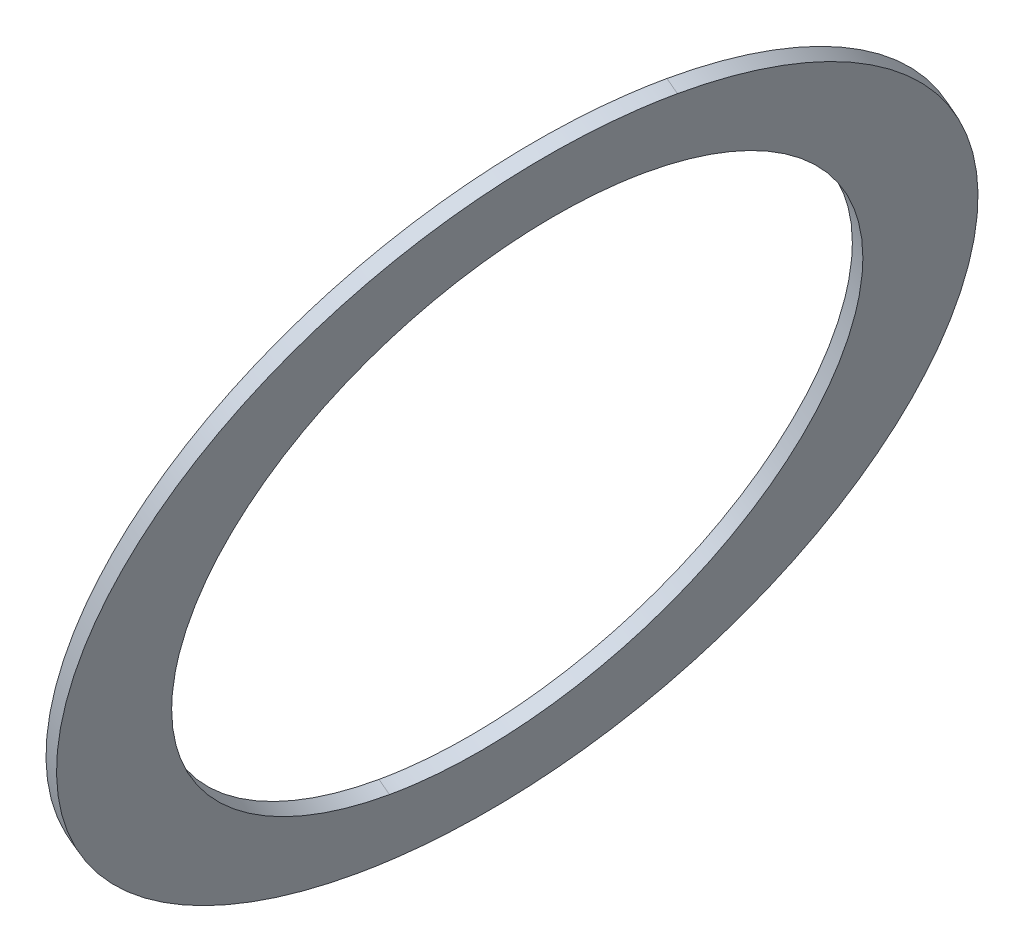
ISO-10303-21;
HEADER;
FILE_DESCRIPTION(('STEP AP214'),'2;1');
FILE_NAME('part.step','',(''),(''),'','','');
FILE_SCHEMA(('AUTOMOTIVE_DESIGN { 1 0 10303 214 1 1 1 1 }'));
ENDSEC;
DATA;
#1=APPLICATION_CONTEXT('core data for automotive mechanical design processes');
#2=APPLICATION_PROTOCOL_DEFINITION('international standard','automotive_design',2000,#1);
#3=PRODUCT_CONTEXT('',#1,'mechanical');
#4=PRODUCT('Part','Part','',(#3));
#5=PRODUCT_RELATED_PRODUCT_CATEGORY('part','',(#4));
#6=PRODUCT_DEFINITION_FORMATION('','',#4);
#7=PRODUCT_DEFINITION_CONTEXT('part definition',#1,'design');
#8=PRODUCT_DEFINITION('design','',#6,#7);
#9=PRODUCT_DEFINITION_SHAPE('','',#8);
#10=(LENGTH_UNIT() NAMED_UNIT(*) SI_UNIT(.MILLI.,.METRE.));
#11=(NAMED_UNIT(*) PLANE_ANGLE_UNIT() SI_UNIT($,.RADIAN.));
#12=(NAMED_UNIT(*) SI_UNIT($,.STERADIAN.) SOLID_ANGLE_UNIT());
#13=UNCERTAINTY_MEASURE_WITH_UNIT(LENGTH_MEASURE(1.E-05),#10,'distance_accuracy_value','');
#14=(GEOMETRIC_REPRESENTATION_CONTEXT(3) GLOBAL_UNCERTAINTY_ASSIGNED_CONTEXT((#13)) GLOBAL_UNIT_ASSIGNED_CONTEXT((#10,
#11,#12)) REPRESENTATION_CONTEXT('',''));
#15=CARTESIAN_POINT('',(0.,0.,0.));
#16=DIRECTION('',(0.,0.,1.));
#17=DIRECTION('',(1.,0.,0.));
#18=AXIS2_PLACEMENT_3D('',#15,#16,#17);
#19=CARTESIAN_POINT('',(-144.227128583511,60.3736028825918,-140.76318788377));
#20=CARTESIAN_POINT('',(-144.250846109872,60.3778785643696,-140.629687018861));
#21=CARTESIAN_POINT('',(-144.26073472639,60.4159766948373,-140.494893857274));
#22=CARTESIAN_POINT('',(-144.254387010655,60.4877548396206,-140.371723937592));
#23=CARTESIAN_POINT('',(-144.209627708789,60.7102810297389,-140.121191960141));
#24=CARTESIAN_POINT('',(-144.108019334336,61.0180985513555,-139.982467653901));
#25=CARTESIAN_POINT('',(-144.035286032677,61.2115475418357,-139.941766379022));
#26=CARTESIAN_POINT('',(-143.897642443855,61.5429373472106,-139.94035648523));
#27=CARTESIAN_POINT('',(-143.752515715508,61.8369160140306,-140.059647796519));
#28=CARTESIAN_POINT('',(-143.69213029429,61.9492143052552,-140.131122833859));
#29=CARTESIAN_POINT('',(-143.603782133636,62.0945954927457,-140.276921262348));
#30=CARTESIAN_POINT('',(-143.53385879928,62.1755594337511,-140.466614751167));
#31=CARTESIAN_POINT('',(-143.512078593367,62.1948247504121,-140.538675476068));
#32=CARTESIAN_POINT('',(-143.494263927853,62.2032150484233,-140.613669713486));
#33=CARTESIAN_POINT('',(-143.480858302723,62.2007983466927,-140.689127099815));
#34=B_SPLINE_CURVE_WITH_KNOTS('',5,(#19,#20,#21,#22,#23,#24,#25,#26,#27,#28,#29,#30,#31,#32,
#33),.UNSPECIFIED.,.F.,.F.,(6,3,3,3,6),(0.,0.249030806576429,0.604169804532782,
0.859242756203596,1.),.UNSPECIFIED.);
#35=DIRECTION('',(-0.909215143405846,0.378383579710355,-0.173648177666983));
#36=VECTOR('',#35,1.);
#37=SURFACE_OF_LINEAR_EXTRUSION('',#34,#36);
#38=DIRECTION('',(0.909215143405846,-0.378383579710355,0.173648177666983));
#39=VECTOR('',#38,1.);
#40=CARTESIAN_POINT('',(-144.240766810662,60.3792786362875,-140.765792606435));
#41=LINE('',#40,#39);
#42=CARTESIAN_POINT('',(-144.254405037813,60.3849543899831,-140.7683973291));
#43=VERTEX_POINT('',#42);
#44=CARTESIAN_POINT('',(-144.227128583511,60.3736028825918,-140.76318788377));
#45=VERTEX_POINT('',#44);
#46=EDGE_CURVE('E11',#43,#45,#41,.T.);
#47=ORIENTED_EDGE('',*,*,#46,.T.);
#48=CARTESIAN_POINT('',(-144.227128583511,60.3736028825918,-140.76318788377));
#49=CARTESIAN_POINT('',(-144.250846109872,60.3778785643696,-140.629687018861));
#50=CARTESIAN_POINT('',(-144.26073472639,60.4159766948373,-140.494893857274));
#51=CARTESIAN_POINT('',(-144.254387010655,60.4877548396206,-140.371723937592));
#52=CARTESIAN_POINT('',(-144.209627708789,60.7102810297389,-140.121191960141));
#53=CARTESIAN_POINT('',(-144.108019334336,61.0180985513555,-139.982467653901));
#54=CARTESIAN_POINT('',(-144.035286032677,61.2115475418357,-139.941766379022));
#55=CARTESIAN_POINT('',(-143.897642443855,61.5429373472106,-139.94035648523));
#56=CARTESIAN_POINT('',(-143.752515715508,61.8369160140306,-140.059647796519));
#57=CARTESIAN_POINT('',(-143.69213029429,61.9492143052552,-140.131122833859));
#58=CARTESIAN_POINT('',(-143.603782133636,62.0945954927457,-140.276921262348));
#59=CARTESIAN_POINT('',(-143.53385879928,62.1755594337511,-140.466614751167));
#60=CARTESIAN_POINT('',(-143.512078593367,62.1948247504121,-140.538675476068));
#61=CARTESIAN_POINT('',(-143.494263927853,62.2032150484233,-140.613669713486));
#62=CARTESIAN_POINT('',(-143.480858302723,62.2007983466927,-140.689127099815));
#63=B_SPLINE_CURVE_WITH_KNOTS('',5,(#48,#49,#50,#51,#52,#53,#54,#55,#56,#57,#58,#59,#60,#61,
#62),.UNSPECIFIED.,.F.,.F.,(6,3,3,3,6),(0.,0.249030806576429,0.604169804532782,
0.859242756203596,1.),.UNSPECIFIED.);
#64=CARTESIAN_POINT('',(-143.480858302723,62.2007983466927,-140.689127099815));
#65=VERTEX_POINT('',#64);
#66=EDGE_CURVE('E33',#45,#65,#63,.T.);
#67=ORIENTED_EDGE('',*,*,#66,.T.);
#68=DIRECTION('',(0.909215143405846,-0.378383579710355,0.173648177666983));
#69=VECTOR('',#68,1.);
#70=CARTESIAN_POINT('',(-143.494496529874,62.2064741003884,-140.69173182248));
#71=LINE('',#70,#69);
#72=CARTESIAN_POINT('',(-143.508134757025,62.212149854084,-140.694336545145));
#73=VERTEX_POINT('',#72);
#74=EDGE_CURVE('E107',#73,#65,#71,.T.);
#75=ORIENTED_EDGE('',*,*,#74,.F.);
#76=CARTESIAN_POINT('',(-144.254405037813,60.3849543899831,-140.7683973291));
#77=CARTESIAN_POINT('',(-144.278122564175,60.3892300717609,-140.634896464191));
#78=CARTESIAN_POINT('',(-144.288011180692,60.4273282022286,-140.500103302604));
#79=CARTESIAN_POINT('',(-144.281663464957,60.4991063470119,-140.376933382922));
#80=CARTESIAN_POINT('',(-144.236904163092,60.7216325371302,-140.126401405471));
#81=CARTESIAN_POINT('',(-144.135295788638,61.0294500587468,-139.987677099231));
#82=CARTESIAN_POINT('',(-144.062562486979,61.222899049227,-139.946975824352));
#83=CARTESIAN_POINT('',(-143.924918898157,61.5542888546019,-139.94556593056));
#84=CARTESIAN_POINT('',(-143.77979216981,61.848267521422,-140.064857241849));
#85=CARTESIAN_POINT('',(-143.719406748593,61.9605658126465,-140.136332279189));
#86=CARTESIAN_POINT('',(-143.631058587938,62.105947000137,-140.282130707678));
#87=CARTESIAN_POINT('',(-143.561135253582,62.1869109411425,-140.471824196497));
#88=CARTESIAN_POINT('',(-143.539355047669,62.2061762578034,-140.543884921398));
#89=CARTESIAN_POINT('',(-143.521540382156,62.2145665558146,-140.618879158816));
#90=CARTESIAN_POINT('',(-143.508134757025,62.212149854084,-140.694336545145));
#91=B_SPLINE_CURVE_WITH_KNOTS('',5,(#76,#77,#78,#79,#80,#81,#82,#83,#84,#85,#86,#87,#88,#89,
#90),.UNSPECIFIED.,.F.,.F.,(6,3,3,3,6),(0.,0.249030806576429,0.604169804532782,
0.859242756203596,1.),.UNSPECIFIED.);
#92=EDGE_CURVE('E65',#43,#73,#91,.T.);
#93=ORIENTED_EDGE('',*,*,#92,.F.);
#94=EDGE_LOOP('',(#47,#67,#75,#93));
#95=FACE_BOUND('',#94,.T.);
#96=ADVANCED_FACE('F17',(#95),#37,.T.);
#97=CARTESIAN_POINT('',(-143.480858302723,62.2007983466927,-140.689127099815));
#98=CARTESIAN_POINT('',(-143.457140776368,62.1965226649434,-140.822627964627));
#99=CARTESIAN_POINT('',(-143.447252159855,62.1584245344676,-140.95742112621));
#100=CARTESIAN_POINT('',(-143.453599875577,62.0866463897086,-141.080591045904));
#101=CARTESIAN_POINT('',(-143.498359177478,61.8641201994808,-141.331123023411));
#102=CARTESIAN_POINT('',(-143.599967551931,61.5563026778642,-141.469847329652));
#103=CARTESIAN_POINT('',(-143.672700853582,61.3628536874003,-141.510548604539));
#104=CARTESIAN_POINT('',(-143.810344442398,61.0314638820782,-141.511958498245));
#105=CARTESIAN_POINT('',(-143.955471170745,60.7374852152581,-141.392667186957));
#106=CARTESIAN_POINT('',(-144.015856591985,60.6251869239483,-141.321192149686));
#107=CARTESIAN_POINT('',(-144.10420475263,60.4798057365187,-141.175393721116));
#108=CARTESIAN_POINT('',(-144.174128086977,60.3988417955295,-140.985700232304));
#109=CARTESIAN_POINT('',(-144.195908292884,60.3795764788401,-140.913639507501));
#110=CARTESIAN_POINT('',(-144.213722958393,60.371186180837,-140.838645270087));
#111=CARTESIAN_POINT('',(-144.227128583511,60.3736028825918,-140.76318788377));
#112=B_SPLINE_CURVE_WITH_KNOTS('',5,(#97,#98,#99,#100,#101,#102,#103,#104,#105,#106,#107,#108,
#109,#110,#111),.UNSPECIFIED.,.F.,.F.,(6,3,3,3,6),(0.,0.249030806593906,0.604169804570402,
0.8592427562129,1.),.UNSPECIFIED.);
#113=DIRECTION('',(-0.909215143405846,0.378383579710355,-0.173648177666983));
#114=VECTOR('',#113,1.);
#115=SURFACE_OF_LINEAR_EXTRUSION('',#112,#114);
#116=ORIENTED_EDGE('',*,*,#74,.T.);
#117=CARTESIAN_POINT('',(-143.480858302723,62.2007983466927,-140.689127099815));
#118=CARTESIAN_POINT('',(-143.457140776368,62.1965226649434,-140.822627964627));
#119=CARTESIAN_POINT('',(-143.447252159855,62.1584245344676,-140.95742112621));
#120=CARTESIAN_POINT('',(-143.453599875577,62.0866463897086,-141.080591045904));
#121=CARTESIAN_POINT('',(-143.498359177478,61.8641201994808,-141.331123023411));
#122=CARTESIAN_POINT('',(-143.599967551931,61.5563026778642,-141.469847329652));
#123=CARTESIAN_POINT('',(-143.672700853582,61.3628536874003,-141.510548604539));
#124=CARTESIAN_POINT('',(-143.810344442398,61.0314638820782,-141.511958498245));
#125=CARTESIAN_POINT('',(-143.955471170745,60.7374852152581,-141.392667186957));
#126=CARTESIAN_POINT('',(-144.015856591985,60.6251869239483,-141.321192149686));
#127=CARTESIAN_POINT('',(-144.10420475263,60.4798057365187,-141.175393721116));
#128=CARTESIAN_POINT('',(-144.174128086977,60.3988417955295,-140.985700232304));
#129=CARTESIAN_POINT('',(-144.195908292884,60.3795764788401,-140.913639507501));
#130=CARTESIAN_POINT('',(-144.213722958393,60.371186180837,-140.838645270087));
#131=CARTESIAN_POINT('',(-144.227128583511,60.3736028825918,-140.76318788377));
#132=B_SPLINE_CURVE_WITH_KNOTS('',5,(#117,#118,#119,#120,#121,#122,#123,#124,#125,#126,#127,
#128,#129,#130,#131),.UNSPECIFIED.,.F.,.F.,(6,3,3,3,6),(0.,0.249030806593906,0.604169804570402,
0.8592427562129,1.),.UNSPECIFIED.);
#133=EDGE_CURVE('E105',#65,#45,#132,.T.);
#134=ORIENTED_EDGE('',*,*,#133,.T.);
#135=ORIENTED_EDGE('',*,*,#46,.F.);
#136=CARTESIAN_POINT('',(-143.508134757025,62.212149854084,-140.694336545145));
#137=CARTESIAN_POINT('',(-143.484417230671,62.2078741723347,-140.827837409957));
#138=CARTESIAN_POINT('',(-143.474528614157,62.1697760418589,-140.96263057154));
#139=CARTESIAN_POINT('',(-143.480876329879,62.0979978971,-141.085800491234));
#140=CARTESIAN_POINT('',(-143.52563563178,61.8754717068722,-141.336332468741));
#141=CARTESIAN_POINT('',(-143.627244006234,61.5676541852555,-141.475056774982));
#142=CARTESIAN_POINT('',(-143.699977307884,61.3742051947916,-141.515758049869));
#143=CARTESIAN_POINT('',(-143.8376208967,61.0428153894695,-141.517167943575));
#144=CARTESIAN_POINT('',(-143.982747625048,60.7488367226494,-141.397876632287));
#145=CARTESIAN_POINT('',(-144.043133046287,60.6365384313396,-141.326401595016));
#146=CARTESIAN_POINT('',(-144.131481206932,60.49115724391,-141.180603166446));
#147=CARTESIAN_POINT('',(-144.201404541279,60.4101933029208,-140.990909677634));
#148=CARTESIAN_POINT('',(-144.223184747186,60.3909279862314,-140.918848952831));
#149=CARTESIAN_POINT('',(-144.240999412695,60.3825376882283,-140.843854715417));
#150=CARTESIAN_POINT('',(-144.254405037813,60.3849543899831,-140.7683973291));
#151=B_SPLINE_CURVE_WITH_KNOTS('',5,(#136,#137,#138,#139,#140,#141,#142,#143,#144,#145,#146,
#147,#148,#149,#150),.UNSPECIFIED.,.F.,.F.,(6,3,3,3,6),(0.,0.249030806593906,0.604169804570402,
0.8592427562129,1.),.UNSPECIFIED.);
#152=EDGE_CURVE('E119',#73,#43,#151,.T.);
#153=ORIENTED_EDGE('',*,*,#152,.F.);
#154=EDGE_LOOP('',(#116,#134,#135,#153));
#155=FACE_BOUND('',#154,.T.);
#156=ADVANCED_FACE('F153',(#155),#115,.T.);
#157=CARTESIAN_POINT('',(-143.853993443125,61.2872006146261,-140.726157491784));
#158=DIRECTION('',(-0.909215143405846,0.378383579710355,-0.173648177666983));
#159=DIRECTION('',(0.377837902996463,0.925112148096128,0.0374970999439055));
#160=AXIS2_PLACEMENT_3D('',#157,#158,#159);
#161=ELLIPSE('',#160,0.787553491698,0.581350260673);
#162=DIRECTION('',(-0.909215143405846,0.378383579710355,-0.173648177666983));
#163=VECTOR('',#162,1.);
#164=SURFACE_OF_LINEAR_EXTRUSION('',#161,#163);
#165=CARTESIAN_POINT('',(-144.178837457236,60.5699768195736,-140.760897909064));
#166=CARTESIAN_POINT('',(-144.181076931475,60.5703787364955,-140.748296321848));
#167=CARTESIAN_POINT('',(-144.18309707969,60.5713144629251,-140.73567993339));
#168=CARTESIAN_POINT('',(-144.186690524437,60.5742300635647,-140.710511631329));
#169=CARTESIAN_POINT('',(-144.188264078476,60.5762093341761,-140.697959684686));
#170=CARTESIAN_POINT('',(-144.19228564741,60.5836411955109,-140.660708699633));
#171=CARTESIAN_POINT('',(-144.194068655913,60.590594735864,-140.636221003422));
#172=CARTESIAN_POINT('',(-144.195895745518,60.608070819608,-140.588573623678));
#173=CARTESIAN_POINT('',(-144.195943220865,60.6185863559949,-140.565411436434));
#174=CARTESIAN_POINT('',(-144.194457171397,60.6426544556931,-140.520747362534));
#175=CARTESIAN_POINT('',(-144.192920812726,60.6562124286323,-140.499248526121));
#176=CARTESIAN_POINT('',(-144.187556629233,60.6916864143307,-140.450036510499));
#177=CARTESIAN_POINT('',(-144.183061052985,60.7147832980765,-140.423246505495));
#178=CARTESIAN_POINT('',(-144.171840416784,60.7644865410461,-140.373692753992));
#179=CARTESIAN_POINT('',(-144.165111070603,60.7910995876327,-140.350936878092));
#180=CARTESIAN_POINT('',(-144.147321893868,60.8560599237924,-140.302530175685));
#181=CARTESIAN_POINT('',(-144.135566099108,60.8953686804917,-140.278428330731));
#182=CARTESIAN_POINT('',(-144.109659397584,60.9766287447398,-140.237007172424));
#183=CARTESIAN_POINT('',(-144.095506705576,61.0185820072266,-140.219692946692));
#184=CARTESIAN_POINT('',(-144.065030185612,61.1048880572578,-140.191203855941));
#185=CARTESIAN_POINT('',(-144.048665387385,61.1492733486569,-140.180172682999));
#186=CARTESIAN_POINT('',(-144.014453247432,61.2386123609024,-140.164634256025));
#187=CARTESIAN_POINT('',(-143.996605201409,61.2835663430946,-140.160130120188));
#188=CARTESIAN_POINT('',(-143.956029906413,61.3823402677192,-140.157350024657));
#189=CARTESIAN_POINT('',(-143.933048883554,61.4361027235716,-140.160528079863));
#190=CARTESIAN_POINT('',(-143.886030050421,61.5417234948964,-140.176566656262));
#191=CARTESIAN_POINT('',(-143.86199271141,61.5935826409325,-140.18942290012));
#192=CARTESIAN_POINT('',(-143.819940413992,61.6802738945429,-140.220704764578));
#193=CARTESIAN_POINT('',(-143.802004375661,61.7159968086726,-140.236776073673));
#194=CARTESIAN_POINT('',(-143.766332050245,61.7842256973011,-140.27488259134));
#195=CARTESIAN_POINT('',(-143.748595488106,61.8167367572936,-140.296908158666));
#196=CARTESIAN_POINT('',(-143.718062300845,61.8697825227293,-140.341190740396));
#197=CARTESIAN_POINT('',(-143.705100025563,61.891320630392,-140.362128654924));
#198=CARTESIAN_POINT('',(-143.680002432944,61.9307331681141,-140.40765780628));
#199=CARTESIAN_POINT('',(-143.667866201842,61.9486116918388,-140.43224490735));
#200=CARTESIAN_POINT('',(-143.647004444481,61.9767994290544,-140.480054500923));
#201=CARTESIAN_POINT('',(-143.638059358426,61.9878931723366,-140.502717090635));
#202=CARTESIAN_POINT('',(-143.621401223777,62.0062448424869,-140.549949706315));
#203=CARTESIAN_POINT('',(-143.613685766562,62.0135103342586,-140.574515859614));
#204=CARTESIAN_POINT('',(-143.602187297314,62.0219558814021,-140.616318348435));
#205=CARTESIAN_POINT('',(-143.59796127922,62.0243669043532,-140.633191938422));
#206=CARTESIAN_POINT('',(-143.590252403601,62.0272359957168,-140.667303493586));
#207=CARTESIAN_POINT('',(-143.586770933798,62.0276904470152,-140.684542074476));
#208=CARTESIAN_POINT('',(-143.583702337635,62.0271274244644,-140.701835965082));
#209=B_SPLINE_CURVE_WITH_KNOTS('',3,(#165,#166,#167,#168,#169,#170,#171,#172,#173,#174,#175,
#176,#177,#178,#179,#180,#181,#182,#183,#184,#185,#186,#187,#188,#189,#190,#191,#192,#193,#194,
#195,#196,#197,#198,#199,#200,#201,#202,#203,#204,#205,#206,#207,#208),.UNSPECIFIED.,.F.,.F.,(4,
2,2,2,2,2,2,2,2,2,2,2,2,2,2,2,2,2,2,2,2,4),(0.,0.03838981886392,0.0767574569105402,
0.152911164048464,0.228915926598186,0.305056916133555,0.411438907244039,0.518026218978843,
0.660016756894382,0.802113520398953,0.947341478586863,1.09263879441312,1.26750509912986,
1.44229416597249,1.57110928764846,1.69971706604732,1.79751998645155,1.89521289785084,
1.97520526813838,2.05503896918373,2.10760170509579,2.16026157212654),.UNSPECIFIED.);
#210=CARTESIAN_POINT('',(-144.17883745723,60.5699768195871,-140.760897909063));
#211=VERTEX_POINT('',#210);
#212=CARTESIAN_POINT('',(-143.58370233763,62.0271274244758,-140.701835965082));
#213=VERTEX_POINT('',#212);
#214=EDGE_CURVE('E70',#211,#213,#209,.T.);
#215=ORIENTED_EDGE('',*,*,#214,.T.);
#216=DIRECTION('',(-0.909215143405846,0.378383579710355,-0.173648177666983));
#217=VECTOR('',#216,1.);
#218=CARTESIAN_POINT('',(-143.570064110474,62.0214516707915,-140.699231242416));
#219=LINE('',#218,#217);
#220=CARTESIAN_POINT('',(-143.556425883328,62.0157759170846,-140.696626519752));
#221=VERTEX_POINT('',#220);
#222=EDGE_CURVE('E67',#221,#213,#219,.T.);
#223=ORIENTED_EDGE('',*,*,#222,.F.);
#224=CARTESIAN_POINT('',(-144.151561002934,60.5586253121823,-140.755688463734));
#225=CARTESIAN_POINT('',(-144.153800477173,60.5590272291042,-140.743086876518));
#226=CARTESIAN_POINT('',(-144.155820625388,60.5599629555338,-140.730470488059));
#227=CARTESIAN_POINT('',(-144.159414070135,60.5628785561735,-140.705302185999));
#228=CARTESIAN_POINT('',(-144.160987624174,60.5648578267849,-140.692750239356));
#229=CARTESIAN_POINT('',(-144.165009193108,60.5722896881197,-140.655499254303));
#230=CARTESIAN_POINT('',(-144.166792201611,60.5792432284727,-140.631011558092));
#231=CARTESIAN_POINT('',(-144.168619291216,60.5967193122167,-140.583364178348));
#232=CARTESIAN_POINT('',(-144.168666766563,60.6072348486037,-140.560201991104));
#233=CARTESIAN_POINT('',(-144.167180717095,60.6313029483019,-140.515537917204));
#234=CARTESIAN_POINT('',(-144.165644358423,60.6448609212411,-140.494039080791));
#235=CARTESIAN_POINT('',(-144.160280174931,60.6803349069393,-140.444827065169));
#236=CARTESIAN_POINT('',(-144.155784598683,60.7034317906851,-140.418037060165));
#237=CARTESIAN_POINT('',(-144.144563962482,60.7531350336548,-140.368483308662));
#238=CARTESIAN_POINT('',(-144.137834616301,60.7797480802414,-140.345727432762));
#239=CARTESIAN_POINT('',(-144.120045439566,60.8447084164011,-140.297320730356));
#240=CARTESIAN_POINT('',(-144.108289644806,60.8840171731004,-140.273218885401));
#241=CARTESIAN_POINT('',(-144.082382943282,60.9652772373485,-140.231797727094));
#242=CARTESIAN_POINT('',(-144.068230251274,61.0072304998353,-140.214483501362));
#243=CARTESIAN_POINT('',(-144.03775373131,61.0935365498665,-140.185994410611));
#244=CARTESIAN_POINT('',(-144.021388933083,61.1379218412655,-140.174963237669));
#245=CARTESIAN_POINT('',(-143.98717679313,61.227260853511,-140.159424810695));
#246=CARTESIAN_POINT('',(-143.969328747107,61.2722148357033,-140.154920674858));
#247=CARTESIAN_POINT('',(-143.928753452111,61.3709887603279,-140.152140579327));
#248=CARTESIAN_POINT('',(-143.905772429252,61.4247512161803,-140.155318634533));
#249=CARTESIAN_POINT('',(-143.858753596119,61.530371987505,-140.171357210932));
#250=CARTESIAN_POINT('',(-143.834716257108,61.5822311335411,-140.18421345479));
#251=CARTESIAN_POINT('',(-143.79266395969,61.6689223871515,-140.215495319248));
#252=CARTESIAN_POINT('',(-143.774727921359,61.7046453012813,-140.231566628343));
#253=CARTESIAN_POINT('',(-143.739055595943,61.7728741899097,-140.26967314601));
#254=CARTESIAN_POINT('',(-143.721319033804,61.8053852499023,-140.291698713336));
#255=CARTESIAN_POINT('',(-143.690785846543,61.858431015338,-140.335981295066));
#256=CARTESIAN_POINT('',(-143.677823571261,61.8799691230008,-140.356919209594));
#257=CARTESIAN_POINT('',(-143.652725978642,61.9193816607228,-140.40244836095));
#258=CARTESIAN_POINT('',(-143.64058974754,61.9372601844475,-140.42703546202));
#259=CARTESIAN_POINT('',(-143.619727990179,61.9654479216631,-140.474845055593));
#260=CARTESIAN_POINT('',(-143.610782904124,61.9765416649453,-140.497507645305));
#261=CARTESIAN_POINT('',(-143.594124769474,61.9948933350957,-140.544740260985));
#262=CARTESIAN_POINT('',(-143.58640931226,62.0021588268673,-140.569306414284));
#263=CARTESIAN_POINT('',(-143.574910843012,62.0106043740108,-140.611108903105));
#264=CARTESIAN_POINT('',(-143.570684824918,62.0130153969619,-140.627982493092));
#265=CARTESIAN_POINT('',(-143.562975949298,62.0158844883256,-140.662094048256));
#266=CARTESIAN_POINT('',(-143.559494479495,62.016338939624,-140.679332629146));
#267=CARTESIAN_POINT('',(-143.556425883333,62.0157759170731,-140.696626519752));
#268=B_SPLINE_CURVE_WITH_KNOTS('',3,(#224,#225,#226,#227,#228,#229,#230,#231,#232,#233,#234,
#235,#236,#237,#238,#239,#240,#241,#242,#243,#244,#245,#246,#247,#248,#249,#250,#251,#252,#253,
#254,#255,#256,#257,#258,#259,#260,#261,#262,#263,#264,#265,#266,#267),.UNSPECIFIED.,.F.,.F.,(4,
2,2,2,2,2,2,2,2,2,2,2,2,2,2,2,2,2,2,2,2,4),(0.,0.0383898188639459,0.0767574569105705,
0.15291116404848,0.228915926598165,0.305056916133534,0.411438907243907,0.518026218978676,
0.660016756894292,0.802113520398901,0.947341478586754,1.09263879441297,1.26750509912969,
1.44229416597232,1.57110928764833,1.69971706604724,1.79751998645147,1.89521289785077,
1.97520526813831,2.05503896918368,2.1076017050958,2.1602615721267),.UNSPECIFIED.);
#269=CARTESIAN_POINT('',(-144.151561002928,60.5586253121959,-140.755688463733));
#270=VERTEX_POINT('',#269);
#271=EDGE_CURVE('E22',#270,#221,#268,.T.);
#272=ORIENTED_EDGE('',*,*,#271,.F.);
#273=DIRECTION('',(-0.909215143405846,0.378383579710355,-0.173648177666983));
#274=VECTOR('',#273,1.);
#275=CARTESIAN_POINT('',(-144.165199230073,60.5643010659048,-140.758293186397));
#276=LINE('',#275,#274);
#277=EDGE_CURVE('E77',#270,#211,#276,.T.);
#278=ORIENTED_EDGE('',*,*,#277,.T.);
#279=EDGE_LOOP('',(#215,#223,#272,#278));
#280=FACE_BOUND('',#279,.T.);
#281=ADVANCED_FACE('F68',(#280),#164,.F.);
#282=CARTESIAN_POINT('',(-143.853993443125,61.2872006146261,-140.726157491784));
#283=DIRECTION('',(-0.909215143405846,0.378383579710355,-0.173648177666983));
#284=DIRECTION('',(0.377837902996463,0.925112148096128,0.0374970999439055));
#285=AXIS2_PLACEMENT_3D('',#282,#283,#284);
#286=ELLIPSE('',#285,0.787553491698,0.581350260673);
#287=DIRECTION('',(-0.909215143405846,0.378383579710355,-0.173648177666983));
#288=VECTOR('',#287,1.);
#289=SURFACE_OF_LINEAR_EXTRUSION('',#286,#288);
#290=CARTESIAN_POINT('',(-143.583702337635,62.0271274244644,-140.701835965082));
#291=CARTESIAN_POINT('',(-143.581462863394,62.0267255075448,-140.714437552297));
#292=CARTESIAN_POINT('',(-143.579442715179,62.0257897811176,-140.727053940755));
#293=CARTESIAN_POINT('',(-143.57584927043,62.0228741804828,-140.752222242815));
#294=CARTESIAN_POINT('',(-143.57427571639,62.0208949098739,-140.764774189457));
#295=CARTESIAN_POINT('',(-143.570254147453,62.0134630485464,-140.802025174508));
#296=CARTESIAN_POINT('',(-143.568471138948,62.0065095081983,-140.826512870719));
#297=CARTESIAN_POINT('',(-143.566644049339,61.9890334244639,-140.874160250464));
#298=CARTESIAN_POINT('',(-143.56659657399,61.9785178880817,-140.897322437708));
#299=CARTESIAN_POINT('',(-143.568082623454,61.9544497883926,-140.941986511611));
#300=CARTESIAN_POINT('',(-143.569618982123,61.9408918154576,-140.963485348024));
#301=CARTESIAN_POINT('',(-143.57498316561,61.9054178297711,-141.012697363647));
#302=CARTESIAN_POINT('',(-143.579478741855,61.8823209460332,-141.03948736865));
#303=CARTESIAN_POINT('',(-143.59069937805,61.832617703079,-141.089041120155));
#304=CARTESIAN_POINT('',(-143.597428724228,61.8060046564998,-141.111796996056));
#305=CARTESIAN_POINT('',(-143.615217900954,61.7410443203572,-141.160203698467));
#306=CARTESIAN_POINT('',(-143.62697369571,61.7017355636674,-141.184305543426));
#307=CARTESIAN_POINT('',(-143.652880397224,61.6204754994374,-141.22572670174));
#308=CARTESIAN_POINT('',(-143.667033089229,61.5785222369593,-141.243040927478));
#309=CARTESIAN_POINT('',(-143.697509609183,61.4922161869446,-141.271530018241));
#310=CARTESIAN_POINT('',(-143.713874407406,61.4478308955533,-141.28256119119));
#311=CARTESIAN_POINT('',(-143.748086547349,61.3584918833224,-141.298099618179));
#312=CARTESIAN_POINT('',(-143.765934593368,61.313537901137,-141.302603754025));
#313=CARTESIAN_POINT('',(-143.806509888356,61.2147639765214,-141.305383849578));
#314=CARTESIAN_POINT('',(-143.829490911212,61.161001520671,-141.302205794383));
#315=CARTESIAN_POINT('',(-143.876509744339,61.0553807493477,-141.286167218012));
#316=CARTESIAN_POINT('',(-143.900547083347,61.0035216033111,-141.273310974167));
#317=CARTESIAN_POINT('',(-143.942599380768,60.9168303496848,-141.242029109731));
#318=CARTESIAN_POINT('',(-143.960535419104,60.8811074355412,-141.225957800642));
#319=CARTESIAN_POINT('',(-143.99620774453,60.8128785468845,-141.187851282985));
#320=CARTESIAN_POINT('',(-144.013944306674,60.7803674868777,-141.165825715662));
#321=CARTESIAN_POINT('',(-144.044477493943,60.7273217214186,-141.121543133936));
#322=CARTESIAN_POINT('',(-144.057439769229,60.7057836137465,-141.100605219411));
#323=CARTESIAN_POINT('',(-144.082537361855,60.6663710760055,-141.055076068058));
#324=CARTESIAN_POINT('',(-144.094673592961,60.6484925522711,-141.030488966988));
#325=CARTESIAN_POINT('',(-144.115535350329,60.620304815039,-140.982679373417));
#326=CARTESIAN_POINT('',(-144.124480436386,60.6092110717497,-140.960016783706));
#327=CARTESIAN_POINT('',(-144.141138571042,60.590859401585,-140.912784168026));
#328=CARTESIAN_POINT('',(-144.148854028259,60.5835939098062,-140.888218014727));
#329=CARTESIAN_POINT('',(-144.160352497521,60.5751483626451,-140.846415525875));
#330=CARTESIAN_POINT('',(-144.164578515624,60.5727373396869,-140.829541935856));
#331=CARTESIAN_POINT('',(-144.172287391259,60.5698682483165,-140.795430380627));
#332=CARTESIAN_POINT('',(-144.175768861068,60.5694137970184,-140.778191799704));
#333=CARTESIAN_POINT('',(-144.178837457236,60.5699768195736,-140.760897909064));
#334=B_SPLINE_CURVE_WITH_KNOTS('',3,(#290,#291,#292,#293,#294,#295,#296,#297,#298,#299,#300,
#301,#302,#303,#304,#305,#306,#307,#308,#309,#310,#311,#312,#313,#314,#315,#316,#317,#318,#319,
#320,#321,#322,#323,#324,#325,#326,#327,#328,#329,#330,#331,#332,#333),.UNSPECIFIED.,.F.,.F.,(4,
2,2,2,2,2,2,2,2,2,2,2,2,2,2,2,2,2,2,2,2,4),(0.,0.0383898188616777,0.0767574569060055,
0.152911164039539,0.228915926585054,0.305056916116137,0.411438907210339,0.51802621892886,
0.660016756823001,0.802113520306166,0.947341478472964,1.09263879427796,1.26750509898365,
1.44229416581571,1.57110928752534,1.6997170659578,1.79751998638022,1.89521289779764,
1.97520526809476,2.05503896914977,2.10760170516178,2.1602615722935),.UNSPECIFIED.);
#335=EDGE_CURVE('E74',#213,#211,#334,.T.);
#336=ORIENTED_EDGE('',*,*,#335,.T.);
#337=ORIENTED_EDGE('',*,*,#277,.F.);
#338=CARTESIAN_POINT('',(-143.556425883332,62.0157759170731,-140.696626519753));
#339=CARTESIAN_POINT('',(-143.554186409092,62.0153740001536,-140.709228106967));
#340=CARTESIAN_POINT('',(-143.552166260877,62.0144382737264,-140.721844495425));
#341=CARTESIAN_POINT('',(-143.548572816128,62.0115226730915,-140.747012797485));
#342=CARTESIAN_POINT('',(-143.546999262088,62.0095434024825,-140.759564744127));
#343=CARTESIAN_POINT('',(-143.542977693151,62.0021115411551,-140.796815729178));
#344=CARTESIAN_POINT('',(-143.541194684646,61.9951580008071,-140.821303425389));
#345=CARTESIAN_POINT('',(-143.539367595037,61.9776819170727,-140.868950805134));
#346=CARTESIAN_POINT('',(-143.539320119688,61.9671663806905,-140.892112992378));
#347=CARTESIAN_POINT('',(-143.540806169152,61.9430982810013,-140.936777066281));
#348=CARTESIAN_POINT('',(-143.542342527821,61.9295403080663,-140.958275902694));
#349=CARTESIAN_POINT('',(-143.547706711308,61.8940663223798,-141.007487918317));
#350=CARTESIAN_POINT('',(-143.552202287553,61.8709694386419,-141.034277923321));
#351=CARTESIAN_POINT('',(-143.563422923748,61.8212661956876,-141.083831674825));
#352=CARTESIAN_POINT('',(-143.570152269926,61.7946531491084,-141.106587550726));
#353=CARTESIAN_POINT('',(-143.587941446652,61.7296928129658,-141.154994253137));
#354=CARTESIAN_POINT('',(-143.599697241408,61.690384056276,-141.179096098096));
#355=CARTESIAN_POINT('',(-143.625603942922,61.609123992046,-141.22051725641));
#356=CARTESIAN_POINT('',(-143.639756634927,61.5671707295679,-141.237831482148));
#357=CARTESIAN_POINT('',(-143.670233154881,61.4808646795532,-141.266320572911));
#358=CARTESIAN_POINT('',(-143.686597953104,61.4364793881619,-141.27735174586));
#359=CARTESIAN_POINT('',(-143.720810093048,61.347140375931,-141.292890172849));
#360=CARTESIAN_POINT('',(-143.738658139066,61.3021863937456,-141.297394308695));
#361=CARTESIAN_POINT('',(-143.779233434054,61.20341246913,-141.300174404248));
#362=CARTESIAN_POINT('',(-143.80221445691,61.1496500132796,-141.296996349053));
#363=CARTESIAN_POINT('',(-143.849233290037,61.0440292419563,-141.280957772682));
#364=CARTESIAN_POINT('',(-143.873270629045,60.9921700959197,-141.268101528837));
#365=CARTESIAN_POINT('',(-143.915322926466,60.9054788422934,-141.236819664401));
#366=CARTESIAN_POINT('',(-143.933258964802,60.8697559281498,-141.220748355312));
#367=CARTESIAN_POINT('',(-143.968931290228,60.8015270394931,-141.182641837655));
#368=CARTESIAN_POINT('',(-143.986667852372,60.7690159794863,-141.160616270332));
#369=CARTESIAN_POINT('',(-144.017201039641,60.7159702140272,-141.116333688606));
#370=CARTESIAN_POINT('',(-144.030163314927,60.6944321063551,-141.095395774081));
#371=CARTESIAN_POINT('',(-144.055260907554,60.6550195686141,-141.049866622728));
#372=CARTESIAN_POINT('',(-144.067397138659,60.6371410448798,-141.025279521658));
#373=CARTESIAN_POINT('',(-144.088258896027,60.6089533076477,-140.977469928087));
#374=CARTESIAN_POINT('',(-144.097203982084,60.5978595643584,-140.954807338376));
#375=CARTESIAN_POINT('',(-144.11386211674,60.5795078941938,-140.907574722696));
#376=CARTESIAN_POINT('',(-144.121577573957,60.572242402415,-140.883008569397));
#377=CARTESIAN_POINT('',(-144.133076043219,60.5637968552539,-140.841206080545));
#378=CARTESIAN_POINT('',(-144.137302061322,60.5613858322957,-140.824332490526));
#379=CARTESIAN_POINT('',(-144.145010936957,60.5585167409252,-140.790220935297));
#380=CARTESIAN_POINT('',(-144.148492406766,60.5580622896272,-140.772982354374));
#381=CARTESIAN_POINT('',(-144.151561002933,60.5586253121823,-140.755688463734));
#382=B_SPLINE_CURVE_WITH_KNOTS('',3,(#338,#339,#340,#341,#342,#343,#344,#345,#346,#347,#348,
#349,#350,#351,#352,#353,#354,#355,#356,#357,#358,#359,#360,#361,#362,#363,#364,#365,#366,#367,
#368,#369,#370,#371,#372,#373,#374,#375,#376,#377,#378,#379,#380,#381),.UNSPECIFIED.,.F.,.F.,(4,
2,2,2,2,2,2,2,2,2,2,2,2,2,2,2,2,2,2,2,2,4),(0.,0.0383898188616582,0.0767574569060151,
0.152911164039488,0.228915926584937,0.305056916115954,0.411438907210259,0.518026218928883,
0.660016756822964,0.802113520306106,0.947341478472898,1.0926387942779,1.26750509898362,
1.44229416581566,1.57110928752531,1.69971706595784,1.7975199863802,1.89521289779757,
1.97520526809467,2.05503896914958,2.10760170516156,2.16026157229328),.UNSPECIFIED.);
#383=EDGE_CURVE('E64',#221,#270,#382,.T.);
#384=ORIENTED_EDGE('',*,*,#383,.F.);
#385=ORIENTED_EDGE('',*,*,#222,.T.);
#386=EDGE_LOOP('',(#336,#337,#384,#385));
#387=FACE_BOUND('',#386,.T.);
#388=ADVANCED_FACE('F76',(#387),#289,.F.);
#389=CARTESIAN_POINT('',(-140.197105636582,63.1845344254721,-155.739144366844));
#390=DIRECTION('',(-0.909215143405846,0.378383579710355,-0.173648177666983));
#391=DIRECTION('',(-0.015180111181639,-0.4469491584612,-0.894430552908015));
#392=AXIS2_PLACEMENT_3D('',#389,#390,#391);
#393=PLANE('',#392);
#394=ORIENTED_EDGE('',*,*,#133,.F.);
#395=ORIENTED_EDGE('',*,*,#66,.F.);
#396=EDGE_LOOP('',(#394,#395));
#397=FACE_BOUND('',#396,.T.);
#398=ORIENTED_EDGE('',*,*,#383,.T.);
#399=ORIENTED_EDGE('',*,*,#271,.T.);
#400=EDGE_LOOP('',(#398,#399));
#401=FACE_BOUND('',#400,.T.);
#402=ADVANCED_FACE('F62',(#397,#401),#393,.F.);
#403=CARTESIAN_POINT('',(-140.224382090884,63.1958859328634,-155.744353812174));
#404=DIRECTION('',(-0.909215143405846,0.378383579710355,-0.173648177666983));
#405=DIRECTION('',(-0.015180111181639,-0.4469491584612,-0.894430552908015));
#406=AXIS2_PLACEMENT_3D('',#403,#404,#405);
#407=PLANE('',#406);
#408=ORIENTED_EDGE('',*,*,#92,.T.);
#409=ORIENTED_EDGE('',*,*,#152,.T.);
#410=EDGE_LOOP('',(#408,#409));
#411=FACE_BOUND('',#410,.T.);
#412=ORIENTED_EDGE('',*,*,#214,.F.);
#413=ORIENTED_EDGE('',*,*,#335,.F.);
#414=EDGE_LOOP('',(#412,#413));
#415=FACE_BOUND('',#414,.T.);
#416=ADVANCED_FACE('F19',(#411,#415),#407,.T.);
#417=CLOSED_SHELL('',(#96,#156,#281,#388,#402,#416));
#418=MANIFOLD_SOLID_BREP('B1',#417);
#419=ADVANCED_BREP_SHAPE_REPRESENTATION('',(#18,#418),#14);
#420=SHAPE_DEFINITION_REPRESENTATION(#9,#419);
ENDSEC;
END-ISO-10303-21;
